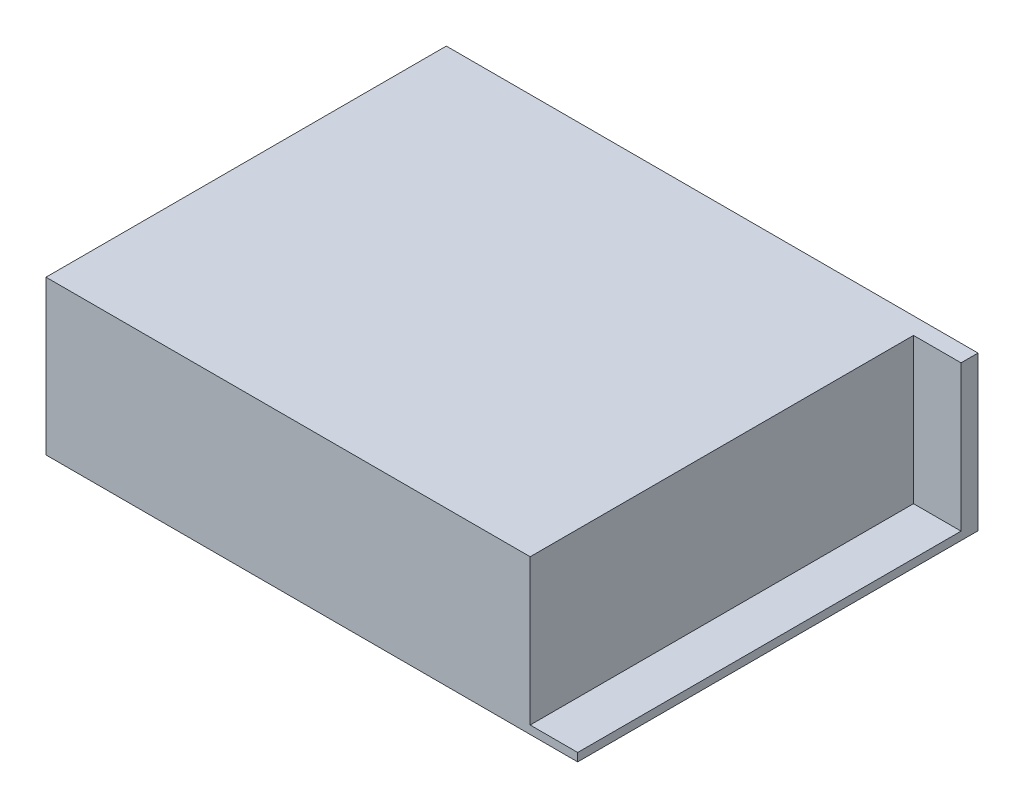
ISO-10303-21;
HEADER;
FILE_DESCRIPTION(('STEP AP214'),'2;1');
FILE_NAME('part.step','',(''),(''),'','','');
FILE_SCHEMA(('AUTOMOTIVE_DESIGN { 1 0 10303 214 1 1 1 1 }'));
ENDSEC;
DATA;
#1=APPLICATION_CONTEXT('core data for automotive mechanical design processes');
#2=APPLICATION_PROTOCOL_DEFINITION('international standard','automotive_design',2000,#1);
#3=PRODUCT_CONTEXT('',#1,'mechanical');
#4=PRODUCT('Part','Part','',(#3));
#5=PRODUCT_RELATED_PRODUCT_CATEGORY('part','',(#4));
#6=PRODUCT_DEFINITION_FORMATION('','',#4);
#7=PRODUCT_DEFINITION_CONTEXT('part definition',#1,'design');
#8=PRODUCT_DEFINITION('design','',#6,#7);
#9=PRODUCT_DEFINITION_SHAPE('','',#8);
#10=(LENGTH_UNIT() NAMED_UNIT(*) SI_UNIT(.MILLI.,.METRE.));
#11=(NAMED_UNIT(*) PLANE_ANGLE_UNIT() SI_UNIT($,.RADIAN.));
#12=(NAMED_UNIT(*) SI_UNIT($,.STERADIAN.) SOLID_ANGLE_UNIT());
#13=UNCERTAINTY_MEASURE_WITH_UNIT(LENGTH_MEASURE(1.E-05),#10,'distance_accuracy_value','');
#14=(GEOMETRIC_REPRESENTATION_CONTEXT(3) GLOBAL_UNCERTAINTY_ASSIGNED_CONTEXT((#13)) GLOBAL_UNIT_ASSIGNED_CONTEXT((#10,
#11,#12)) REPRESENTATION_CONTEXT('',''));
#15=CARTESIAN_POINT('',(0.,0.,0.));
#16=DIRECTION('',(0.,0.,1.));
#17=DIRECTION('',(1.,0.,0.));
#18=AXIS2_PLACEMENT_3D('',#15,#16,#17);
#19=CARTESIAN_POINT('',(0.,37.5,0.));
#20=DIRECTION('',(1.,0.,0.));
#21=DIRECTION('',(0.,0.,-1.));
#22=AXIS2_PLACEMENT_3D('',#19,#20,#21);
#23=PLANE('',#22);
#24=DIRECTION('',(0.,0.,1.));
#25=VECTOR('',#24,1.);
#26=CARTESIAN_POINT('',(0.,0.,0.));
#27=LINE('',#26,#25);
#28=CARTESIAN_POINT('',(0.,0.,-97.5));
#29=VERTEX_POINT('',#28);
#30=CARTESIAN_POINT('',(0.,0.,0.));
#31=VERTEX_POINT('',#30);
#32=EDGE_CURVE('E145',#29,#31,#27,.T.);
#33=ORIENTED_EDGE('',*,*,#32,.T.);
#34=DIRECTION('',(0.,-1.,0.));
#35=VECTOR('',#34,1.);
#36=CARTESIAN_POINT('',(0.,37.5,0.));
#37=LINE('',#36,#35);
#38=CARTESIAN_POINT('',(0.,37.5,0.));
#39=VERTEX_POINT('',#38);
#40=EDGE_CURVE('E11',#39,#31,#37,.T.);
#41=ORIENTED_EDGE('',*,*,#40,.F.);
#42=DIRECTION('',(0.,0.,1.));
#43=VECTOR('',#42,1.);
#44=CARTESIAN_POINT('',(0.,37.5,0.));
#45=LINE('',#44,#43);
#46=CARTESIAN_POINT('',(0.,37.5,-97.5));
#47=VERTEX_POINT('',#46);
#48=EDGE_CURVE('E146',#47,#39,#45,.T.);
#49=ORIENTED_EDGE('',*,*,#48,.F.);
#50=DIRECTION('',(0.,-1.,0.));
#51=VECTOR('',#50,1.);
#52=CARTESIAN_POINT('',(0.,37.5,-97.5));
#53=LINE('',#52,#51);
#54=EDGE_CURVE('E151',#47,#29,#53,.T.);
#55=ORIENTED_EDGE('',*,*,#54,.T.);
#56=EDGE_LOOP('',(#33,#41,#49,#55));
#57=FACE_BOUND('',#56,.T.);
#58=ADVANCED_FACE('F32',(#57),#23,.F.);
#59=CARTESIAN_POINT('',(0.,37.5,0.));
#60=DIRECTION('',(0.,0.,-1.));
#61=DIRECTION('',(-1.,0.,0.));
#62=AXIS2_PLACEMENT_3D('',#59,#60,#61);
#63=PLANE('',#62);
#64=DIRECTION('',(1.,0.,0.));
#65=VECTOR('',#64,1.);
#66=CARTESIAN_POINT('',(129.5,2.,0.));
#67=LINE('',#66,#65);
#68=CARTESIAN_POINT('',(117.924762954047,2.,0.));
#69=VERTEX_POINT('',#68);
#70=CARTESIAN_POINT('',(129.5,2.,0.));
#71=VERTEX_POINT('',#70);
#72=EDGE_CURVE('E118',#69,#71,#67,.T.);
#73=ORIENTED_EDGE('',*,*,#72,.F.);
#74=DIRECTION('',(0.,1.,0.));
#75=VECTOR('',#74,1.);
#76=CARTESIAN_POINT('',(117.924762954047,2.,0.));
#77=LINE('',#76,#75);
#78=CARTESIAN_POINT('',(117.924762954047,37.5,0.));
#79=VERTEX_POINT('',#78);
#80=EDGE_CURVE('E128',#69,#79,#77,.T.);
#81=ORIENTED_EDGE('',*,*,#80,.T.);
#82=DIRECTION('',(1.,0.,0.));
#83=VECTOR('',#82,1.);
#84=CARTESIAN_POINT('',(0.,37.5,0.));
#85=LINE('',#84,#83);
#86=EDGE_CURVE('E81',#39,#79,#85,.T.);
#87=ORIENTED_EDGE('',*,*,#86,.F.);
#88=ORIENTED_EDGE('',*,*,#40,.T.);
#89=DIRECTION('',(1.,0.,0.));
#90=VECTOR('',#89,1.);
#91=CARTESIAN_POINT('',(0.,0.,0.));
#92=LINE('',#91,#90);
#93=CARTESIAN_POINT('',(129.5,0.,0.));
#94=VERTEX_POINT('',#93);
#95=EDGE_CURVE('E154',#31,#94,#92,.T.);
#96=ORIENTED_EDGE('',*,*,#95,.T.);
#97=DIRECTION('',(0.,-1.,0.));
#98=VECTOR('',#97,1.);
#99=CARTESIAN_POINT('',(129.5,37.5,0.));
#100=LINE('',#99,#98);
#101=EDGE_CURVE('E39',#71,#94,#100,.T.);
#102=ORIENTED_EDGE('',*,*,#101,.F.);
#103=EDGE_LOOP('',(#73,#81,#87,#88,#96,#102));
#104=FACE_BOUND('',#103,.T.);
#105=ADVANCED_FACE('F163',(#104),#63,.F.);
#106=CARTESIAN_POINT('',(129.5,37.5,0.));
#107=DIRECTION('',(-1.,0.,0.));
#108=DIRECTION('',(0.,0.,1.));
#109=AXIS2_PLACEMENT_3D('',#106,#107,#108);
#110=PLANE('',#109);
#111=DIRECTION('',(0.,0.,-1.));
#112=VECTOR('',#111,1.);
#113=CARTESIAN_POINT('',(129.5,37.5,0.));
#114=LINE('',#113,#112);
#115=CARTESIAN_POINT('',(129.5,37.5,-93.3702809384158));
#116=VERTEX_POINT('',#115);
#117=CARTESIAN_POINT('',(129.5,37.5,-97.5));
#118=VERTEX_POINT('',#117);
#119=EDGE_CURVE('E126',#116,#118,#114,.T.);
#120=ORIENTED_EDGE('',*,*,#119,.F.);
#121=DIRECTION('',(0.,1.,0.));
#122=VECTOR('',#121,1.);
#123=CARTESIAN_POINT('',(129.5,2.,-93.3702809384158));
#124=LINE('',#123,#122);
#125=CARTESIAN_POINT('',(129.5,2.,-93.3702809384158));
#126=VERTEX_POINT('',#125);
#127=EDGE_CURVE('E46',#126,#116,#124,.T.);
#128=ORIENTED_EDGE('',*,*,#127,.F.);
#129=DIRECTION('',(0.,0.,-1.));
#130=VECTOR('',#129,1.);
#131=CARTESIAN_POINT('',(129.5,2.,0.));
#132=LINE('',#131,#130);
#133=EDGE_CURVE('E113',#71,#126,#132,.T.);
#134=ORIENTED_EDGE('',*,*,#133,.F.);
#135=ORIENTED_EDGE('',*,*,#101,.T.);
#136=DIRECTION('',(0.,0.,-1.));
#137=VECTOR('',#136,1.);
#138=CARTESIAN_POINT('',(129.5,0.,0.));
#139=LINE('',#138,#137);
#140=CARTESIAN_POINT('',(129.5,0.,-97.5));
#141=VERTEX_POINT('',#140);
#142=EDGE_CURVE('E157',#94,#141,#139,.T.);
#143=ORIENTED_EDGE('',*,*,#142,.T.);
#144=DIRECTION('',(0.,-1.,0.));
#145=VECTOR('',#144,1.);
#146=CARTESIAN_POINT('',(129.5,37.5,-97.5));
#147=LINE('',#146,#145);
#148=EDGE_CURVE('E161',#118,#141,#147,.T.);
#149=ORIENTED_EDGE('',*,*,#148,.F.);
#150=EDGE_LOOP('',(#120,#128,#134,#135,#143,#149));
#151=FACE_BOUND('',#150,.T.);
#152=ADVANCED_FACE('F124',(#151),#110,.F.);
#153=CARTESIAN_POINT('',(0.,37.5,-97.5));
#154=DIRECTION('',(0.,0.,1.));
#155=DIRECTION('',(1.,0.,0.));
#156=AXIS2_PLACEMENT_3D('',#153,#154,#155);
#157=PLANE('',#156);
#158=DIRECTION('',(-1.,0.,0.));
#159=VECTOR('',#158,1.);
#160=CARTESIAN_POINT('',(0.,0.,-97.5));
#161=LINE('',#160,#159);
#162=EDGE_CURVE('E75',#141,#29,#161,.T.);
#163=ORIENTED_EDGE('',*,*,#162,.T.);
#164=ORIENTED_EDGE('',*,*,#54,.F.);
#165=DIRECTION('',(-1.,0.,0.));
#166=VECTOR('',#165,1.);
#167=CARTESIAN_POINT('',(0.,37.5,-97.5));
#168=LINE('',#167,#166);
#169=EDGE_CURVE('E55',#118,#47,#168,.T.);
#170=ORIENTED_EDGE('',*,*,#169,.F.);
#171=ORIENTED_EDGE('',*,*,#148,.T.);
#172=EDGE_LOOP('',(#163,#164,#170,#171));
#173=FACE_BOUND('',#172,.T.);
#174=ADVANCED_FACE('F170',(#173),#157,.F.);
#175=CARTESIAN_POINT('',(0.,37.5,0.));
#176=DIRECTION('',(0.,-1.,0.));
#177=DIRECTION('',(0.,0.,-1.));
#178=AXIS2_PLACEMENT_3D('',#175,#176,#177);
#179=PLANE('',#178);
#180=ORIENTED_EDGE('',*,*,#86,.T.);
#181=DIRECTION('',(0.,0.,1.));
#182=VECTOR('',#181,1.);
#183=CARTESIAN_POINT('',(117.924762954047,37.5,0.));
#184=LINE('',#183,#182);
#185=CARTESIAN_POINT('',(117.924762954047,37.5,-93.3702809384158));
#186=VERTEX_POINT('',#185);
#187=EDGE_CURVE('E121',#186,#79,#184,.T.);
#188=ORIENTED_EDGE('',*,*,#187,.F.);
#189=DIRECTION('',(-1.,0.,0.));
#190=VECTOR('',#189,1.);
#191=CARTESIAN_POINT('',(129.5,37.5,-93.3702809384158));
#192=LINE('',#191,#190);
#193=EDGE_CURVE('E295',#116,#186,#192,.T.);
#194=ORIENTED_EDGE('',*,*,#193,.F.);
#195=ORIENTED_EDGE('',*,*,#119,.T.);
#196=ORIENTED_EDGE('',*,*,#169,.T.);
#197=ORIENTED_EDGE('',*,*,#48,.T.);
#198=EDGE_LOOP('',(#180,#188,#194,#195,#196,#197));
#199=FACE_BOUND('',#198,.T.);
#200=ADVANCED_FACE('F172',(#199),#179,.F.);
#201=CARTESIAN_POINT('',(0.,0.,0.));
#202=DIRECTION('',(0.,-1.,0.));
#203=DIRECTION('',(0.,0.,-1.));
#204=AXIS2_PLACEMENT_3D('',#201,#202,#203);
#205=PLANE('',#204);
#206=CARTESIAN_POINT('',(51.5,0.,-63.75));
#207=DIRECTION('',(0.,-1.,0.));
#208=DIRECTION('',(0.,0.,-1.));
#209=AXIS2_PLACEMENT_3D('',#206,#207,#208);
#210=CIRCLE('',#209,1.7);
#211=CARTESIAN_POINT('',(51.5,0.,-65.45));
#212=VERTEX_POINT('',#211);
#213=EDGE_CURVE('E133',#212,#212,#210,.T.);
#214=ORIENTED_EDGE('',*,*,#213,.F.);
#215=EDGE_LOOP('',(#214));
#216=FACE_BOUND('',#215,.T.);
#217=CARTESIAN_POINT('',(51.5,0.,-30.75));
#218=DIRECTION('',(0.,-1.,0.));
#219=DIRECTION('',(0.,0.,-1.));
#220=AXIS2_PLACEMENT_3D('',#217,#218,#219);
#221=CIRCLE('',#220,1.7);
#222=CARTESIAN_POINT('',(51.5,0.,-32.45));
#223=VERTEX_POINT('',#222);
#224=EDGE_CURVE('E139',#223,#223,#221,.T.);
#225=ORIENTED_EDGE('',*,*,#224,.F.);
#226=EDGE_LOOP('',(#225));
#227=FACE_BOUND('',#226,.T.);
#228=ORIENTED_EDGE('',*,*,#32,.F.);
#229=ORIENTED_EDGE('',*,*,#162,.F.);
#230=ORIENTED_EDGE('',*,*,#142,.F.);
#231=ORIENTED_EDGE('',*,*,#95,.F.);
#232=EDGE_LOOP('',(#228,#229,#230,#231));
#233=FACE_BOUND('',#232,.T.);
#234=ADVANCED_FACE('F167',(#216,#227,#233),#205,.T.);
#235=CARTESIAN_POINT('',(51.5,0.737,-30.75));
#236=DIRECTION('',(0.,-1.,0.));
#237=DIRECTION('',(0.,0.,-1.));
#238=AXIS2_PLACEMENT_3D('',#235,#236,#237);
#239=CONICAL_SURFACE('',#238,1.7,1.02974425867665);
#240=CARTESIAN_POINT('',(51.5,1.75846305234685,-30.75));
#241=VERTEX_POINT('',#240);
#242=VERTEX_LOOP('',#241);
#243=FACE_BOUND('',#242,.T.);
#244=CARTESIAN_POINT('',(51.5,0.737,-30.75));
#245=DIRECTION('',(0.,-1.,0.));
#246=DIRECTION('',(0.,0.,-1.));
#247=AXIS2_PLACEMENT_3D('',#244,#245,#246);
#248=CIRCLE('',#247,1.7);
#249=CARTESIAN_POINT('',(51.5,0.737,-32.45));
#250=VERTEX_POINT('',#249);
#251=EDGE_CURVE('E142',#250,#250,#248,.T.);
#252=ORIENTED_EDGE('',*,*,#251,.T.);
#253=EDGE_LOOP('',(#252));
#254=FACE_BOUND('',#253,.T.);
#255=ADVANCED_FACE('F244',(#243,#254),#239,.F.);
#256=CARTESIAN_POINT('',(51.5,0.,-30.75));
#257=DIRECTION('',(0.,-1.,0.));
#258=DIRECTION('',(0.,0.,-1.));
#259=AXIS2_PLACEMENT_3D('',#256,#257,#258);
#260=CYLINDRICAL_SURFACE('',#259,1.7);
#261=ORIENTED_EDGE('',*,*,#251,.F.);
#262=EDGE_LOOP('',(#261));
#263=FACE_BOUND('',#262,.T.);
#264=ORIENTED_EDGE('',*,*,#224,.T.);
#265=EDGE_LOOP('',(#264));
#266=FACE_BOUND('',#265,.T.);
#267=ADVANCED_FACE('F240',(#263,#266),#260,.F.);
#268=CARTESIAN_POINT('',(51.5,0.737,-63.75));
#269=DIRECTION('',(0.,-1.,0.));
#270=DIRECTION('',(0.,0.,-1.));
#271=AXIS2_PLACEMENT_3D('',#268,#269,#270);
#272=CONICAL_SURFACE('',#271,1.7,1.02974425867665);
#273=CARTESIAN_POINT('',(51.5,1.75846305234685,-63.75));
#274=VERTEX_POINT('',#273);
#275=VERTEX_LOOP('',#274);
#276=FACE_BOUND('',#275,.T.);
#277=CARTESIAN_POINT('',(51.5,0.737,-63.75));
#278=DIRECTION('',(0.,-1.,0.));
#279=DIRECTION('',(0.,0.,-1.));
#280=AXIS2_PLACEMENT_3D('',#277,#278,#279);
#281=CIRCLE('',#280,1.7);
#282=CARTESIAN_POINT('',(51.5,0.737,-65.45));
#283=VERTEX_POINT('',#282);
#284=EDGE_CURVE('E136',#283,#283,#281,.T.);
#285=ORIENTED_EDGE('',*,*,#284,.T.);
#286=EDGE_LOOP('',(#285));
#287=FACE_BOUND('',#286,.T.);
#288=ADVANCED_FACE('F236',(#276,#287),#272,.F.);
#289=CARTESIAN_POINT('',(51.5,0.,-63.75));
#290=DIRECTION('',(0.,-1.,0.));
#291=DIRECTION('',(0.,0.,-1.));
#292=AXIS2_PLACEMENT_3D('',#289,#290,#291);
#293=CYLINDRICAL_SURFACE('',#292,1.7);
#294=ORIENTED_EDGE('',*,*,#284,.F.);
#295=EDGE_LOOP('',(#294));
#296=FACE_BOUND('',#295,.T.);
#297=ORIENTED_EDGE('',*,*,#213,.T.);
#298=EDGE_LOOP('',(#297));
#299=FACE_BOUND('',#298,.T.);
#300=ADVANCED_FACE('F211',(#296,#299),#293,.F.);
#301=CARTESIAN_POINT('',(117.924762954047,2.,0.));
#302=DIRECTION('',(-1.,0.,0.));
#303=DIRECTION('',(0.,0.,1.));
#304=AXIS2_PLACEMENT_3D('',#301,#302,#303);
#305=PLANE('',#304);
#306=ORIENTED_EDGE('',*,*,#187,.T.);
#307=ORIENTED_EDGE('',*,*,#80,.F.);
#308=DIRECTION('',(0.,0.,1.));
#309=VECTOR('',#308,1.);
#310=CARTESIAN_POINT('',(117.924762954047,2.,0.));
#311=LINE('',#310,#309);
#312=CARTESIAN_POINT('',(117.924762954047,2.,-93.3702809384158));
#313=VERTEX_POINT('',#312);
#314=EDGE_CURVE('E112',#313,#69,#311,.T.);
#315=ORIENTED_EDGE('',*,*,#314,.F.);
#316=DIRECTION('',(0.,1.,0.));
#317=VECTOR('',#316,1.);
#318=CARTESIAN_POINT('',(117.924762954047,2.,-93.3702809384158));
#319=LINE('',#318,#317);
#320=EDGE_CURVE('E108',#313,#186,#319,.T.);
#321=ORIENTED_EDGE('',*,*,#320,.T.);
#322=EDGE_LOOP('',(#306,#307,#315,#321));
#323=FACE_BOUND('',#322,.T.);
#324=ADVANCED_FACE('F206',(#323),#305,.F.);
#325=CARTESIAN_POINT('',(129.5,2.,-93.3702809384158));
#326=DIRECTION('',(0.,0.,-1.));
#327=DIRECTION('',(-1.,0.,0.));
#328=AXIS2_PLACEMENT_3D('',#325,#326,#327);
#329=PLANE('',#328);
#330=ORIENTED_EDGE('',*,*,#193,.T.);
#331=ORIENTED_EDGE('',*,*,#320,.F.);
#332=DIRECTION('',(-1.,0.,0.));
#333=VECTOR('',#332,1.);
#334=CARTESIAN_POINT('',(129.5,2.,-93.3702809384158));
#335=LINE('',#334,#333);
#336=EDGE_CURVE('E105',#126,#313,#335,.T.);
#337=ORIENTED_EDGE('',*,*,#336,.F.);
#338=ORIENTED_EDGE('',*,*,#127,.T.);
#339=EDGE_LOOP('',(#330,#331,#337,#338));
#340=FACE_BOUND('',#339,.T.);
#341=ADVANCED_FACE('F107',(#340),#329,.F.);
#342=CARTESIAN_POINT('',(0.,2.,0.));
#343=DIRECTION('',(0.,1.,0.));
#344=DIRECTION('',(0.,0.,1.));
#345=AXIS2_PLACEMENT_3D('',#342,#343,#344);
#346=PLANE('',#345);
#347=ORIENTED_EDGE('',*,*,#133,.T.);
#348=ORIENTED_EDGE('',*,*,#336,.T.);
#349=ORIENTED_EDGE('',*,*,#314,.T.);
#350=ORIENTED_EDGE('',*,*,#72,.T.);
#351=EDGE_LOOP('',(#347,#348,#349,#350));
#352=FACE_BOUND('',#351,.T.);
#353=ADVANCED_FACE('F116',(#352),#346,.T.);
#354=CLOSED_SHELL('',(#58,#105,#152,#174,#200,#234,#255,#267,#288,#300,#324,#341,#353));
#355=MANIFOLD_SOLID_BREP('B2',#354);
#356=ADVANCED_BREP_SHAPE_REPRESENTATION('',(#18,#355),#14);
#357=SHAPE_DEFINITION_REPRESENTATION(#9,#356);
ENDSEC;
END-ISO-10303-21;
